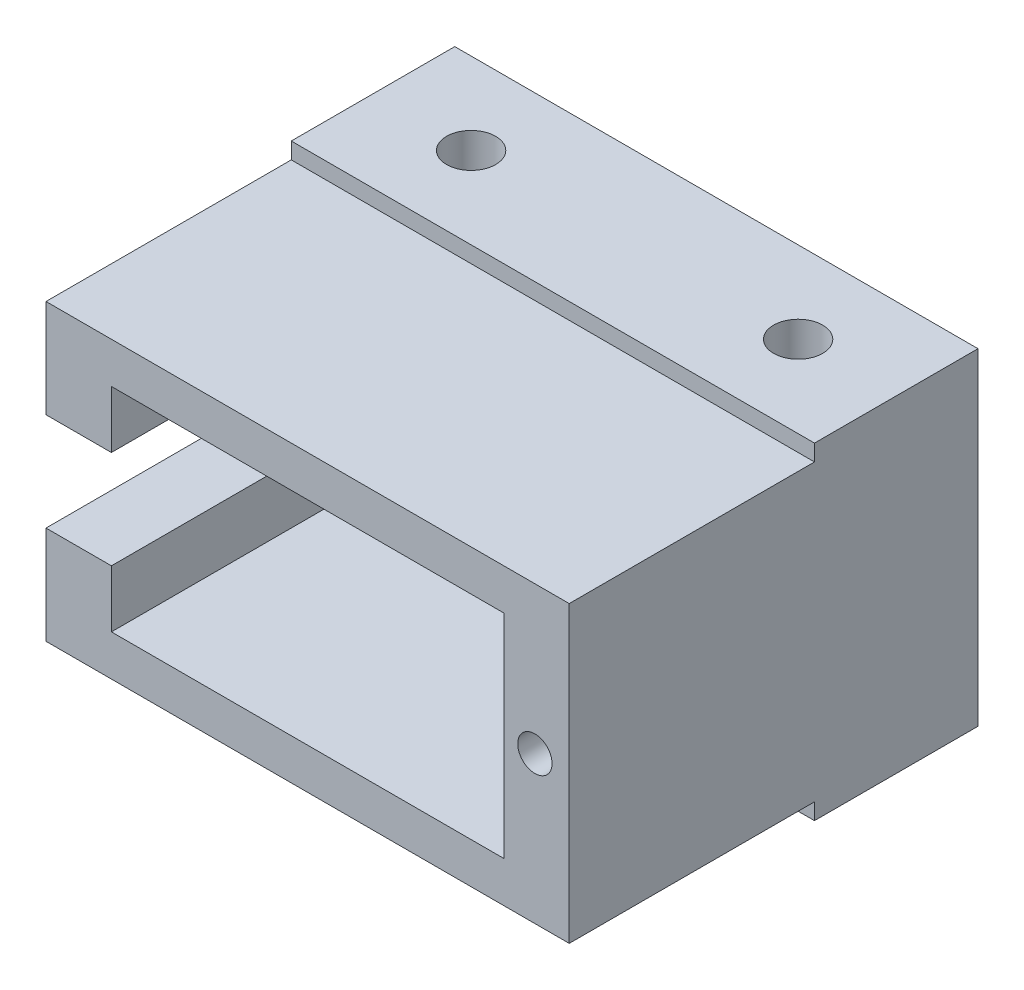
ISO-10303-21;
HEADER;
FILE_DESCRIPTION(('STEP AP214'),'2;1');
FILE_NAME('part.step','',(''),(''),'','','');
FILE_SCHEMA(('AUTOMOTIVE_DESIGN { 1 0 10303 214 1 1 1 1 }'));
ENDSEC;
DATA;
#1=APPLICATION_CONTEXT('core data for automotive mechanical design processes');
#2=APPLICATION_PROTOCOL_DEFINITION('international standard','automotive_design',2000,#1);
#3=PRODUCT_CONTEXT('',#1,'mechanical');
#4=PRODUCT('Part','Part','',(#3));
#5=PRODUCT_RELATED_PRODUCT_CATEGORY('part','',(#4));
#6=PRODUCT_DEFINITION_FORMATION('','',#4);
#7=PRODUCT_DEFINITION_CONTEXT('part definition',#1,'design');
#8=PRODUCT_DEFINITION('design','',#6,#7);
#9=PRODUCT_DEFINITION_SHAPE('','',#8);
#10=(LENGTH_UNIT() NAMED_UNIT(*) SI_UNIT(.MILLI.,.METRE.));
#11=(NAMED_UNIT(*) PLANE_ANGLE_UNIT() SI_UNIT($,.RADIAN.));
#12=(NAMED_UNIT(*) SI_UNIT($,.STERADIAN.) SOLID_ANGLE_UNIT());
#13=UNCERTAINTY_MEASURE_WITH_UNIT(LENGTH_MEASURE(1.E-05),#10,'distance_accuracy_value','');
#14=(GEOMETRIC_REPRESENTATION_CONTEXT(3) GLOBAL_UNCERTAINTY_ASSIGNED_CONTEXT((#13)) GLOBAL_UNIT_ASSIGNED_CONTEXT((#10,
#11,#12)) REPRESENTATION_CONTEXT('',''));
#15=CARTESIAN_POINT('',(0.,0.,0.));
#16=DIRECTION('',(0.,0.,1.));
#17=DIRECTION('',(1.,0.,0.));
#18=AXIS2_PLACEMENT_3D('',#15,#16,#17);
#19=CARTESIAN_POINT('',(-16.,10.,10.));
#20=DIRECTION('',(1.,0.,0.));
#21=DIRECTION('',(0.,0.,-1.));
#22=AXIS2_PLACEMENT_3D('',#19,#20,#21);
#23=PLANE('',#22);
#24=DIRECTION('',(0.,-1.,0.));
#25=VECTOR('',#24,1.);
#26=CARTESIAN_POINT('',(-16.,10.,0.));
#27=LINE('',#26,#25);
#28=CARTESIAN_POINT('',(-16.,10.,0.));
#29=VERTEX_POINT('',#28);
#30=CARTESIAN_POINT('',(-16.,3.,0.));
#31=VERTEX_POINT('',#30);
#32=EDGE_CURVE('E265',#29,#31,#27,.T.);
#33=ORIENTED_EDGE('',*,*,#32,.T.);
#34=DIRECTION('',(0.,0.,-1.));
#35=VECTOR('',#34,1.);
#36=CARTESIAN_POINT('',(-16.,3.,0.));
#37=LINE('',#36,#35);
#38=CARTESIAN_POINT('',(-16.,3.,25.));
#39=VERTEX_POINT('',#38);
#40=EDGE_CURVE('E171',#39,#31,#37,.T.);
#41=ORIENTED_EDGE('',*,*,#40,.F.);
#42=DIRECTION('',(0.,-1.,0.));
#43=VECTOR('',#42,1.);
#44=CARTESIAN_POINT('',(-16.,-9.00000000000001,25.));
#45=LINE('',#44,#43);
#46=CARTESIAN_POINT('',(-16.,9.,25.));
#47=VERTEX_POINT('',#46);
#48=EDGE_CURVE('E222',#47,#39,#45,.T.);
#49=ORIENTED_EDGE('',*,*,#48,.F.);
#50=DIRECTION('',(0.,0.,-1.));
#51=VECTOR('',#50,1.);
#52=CARTESIAN_POINT('',(-16.,9.,25.));
#53=LINE('',#52,#51);
#54=CARTESIAN_POINT('',(-16.,9.,10.));
#55=VERTEX_POINT('',#54);
#56=EDGE_CURVE('E232',#47,#55,#53,.T.);
#57=ORIENTED_EDGE('',*,*,#56,.T.);
#58=DIRECTION('',(0.,-1.,0.));
#59=VECTOR('',#58,1.);
#60=CARTESIAN_POINT('',(-16.,10.,10.));
#61=LINE('',#60,#59);
#62=CARTESIAN_POINT('',(-16.,10.,10.));
#63=VERTEX_POINT('',#62);
#64=EDGE_CURVE('E256',#63,#55,#61,.T.);
#65=ORIENTED_EDGE('',*,*,#64,.F.);
#66=DIRECTION('',(0.,0.,-1.));
#67=VECTOR('',#66,1.);
#68=CARTESIAN_POINT('',(-16.,10.,10.));
#69=LINE('',#68,#67);
#70=EDGE_CURVE('E45',#63,#29,#69,.T.);
#71=ORIENTED_EDGE('',*,*,#70,.T.);
#72=EDGE_LOOP('',(#33,#41,#49,#57,#65,#71));
#73=FACE_BOUND('',#72,.T.);
#74=ADVANCED_FACE('F37',(#73),#23,.F.);
#75=CARTESIAN_POINT('',(-12.,6.5,25.));
#76=DIRECTION('',(1.,0.,0.));
#77=DIRECTION('',(0.,0.,-1.));
#78=AXIS2_PLACEMENT_3D('',#75,#76,#77);
#79=PLANE('',#78);
#80=DIRECTION('',(0.,0.,-1.));
#81=VECTOR('',#80,1.);
#82=CARTESIAN_POINT('',(-12.,3.,0.));
#83=LINE('',#82,#81);
#84=CARTESIAN_POINT('',(-12.,3.,25.));
#85=VERTEX_POINT('',#84);
#86=CARTESIAN_POINT('',(-12.,3.,10.));
#87=VERTEX_POINT('',#86);
#88=EDGE_CURVE('E178',#85,#87,#83,.T.);
#89=ORIENTED_EDGE('',*,*,#88,.T.);
#90=DIRECTION('',(0.,-1.,0.));
#91=VECTOR('',#90,1.);
#92=CARTESIAN_POINT('',(-12.,6.5,10.));
#93=LINE('',#92,#91);
#94=CARTESIAN_POINT('',(-12.,6.5,10.));
#95=VERTEX_POINT('',#94);
#96=EDGE_CURVE('E206',#95,#87,#93,.T.);
#97=ORIENTED_EDGE('',*,*,#96,.F.);
#98=DIRECTION('',(0.,0.,-1.));
#99=VECTOR('',#98,1.);
#100=CARTESIAN_POINT('',(-12.,6.5,25.));
#101=LINE('',#100,#99);
#102=CARTESIAN_POINT('',(-12.,6.5,25.));
#103=VERTEX_POINT('',#102);
#104=EDGE_CURVE('E216',#103,#95,#101,.T.);
#105=ORIENTED_EDGE('',*,*,#104,.F.);
#106=DIRECTION('',(0.,-1.,0.));
#107=VECTOR('',#106,1.);
#108=CARTESIAN_POINT('',(-12.,6.5,25.));
#109=LINE('',#108,#107);
#110=EDGE_CURVE('E193',#103,#85,#109,.T.);
#111=ORIENTED_EDGE('',*,*,#110,.T.);
#112=EDGE_LOOP('',(#89,#97,#105,#111));
#113=FACE_BOUND('',#112,.T.);
#114=ADVANCED_FACE('F352',(#113),#79,.T.);
#115=CARTESIAN_POINT('',(0.,0.,10.));
#116=DIRECTION('',(0.,0.,1.));
#117=DIRECTION('',(1.,0.,0.));
#118=AXIS2_PLACEMENT_3D('',#115,#116,#117);
#119=PLANE('',#118);
#120=DIRECTION('',(-1.,0.,0.));
#121=VECTOR('',#120,1.);
#122=CARTESIAN_POINT('',(-16.,9.,10.));
#123=LINE('',#122,#121);
#124=CARTESIAN_POINT('',(16.,9.,10.));
#125=VERTEX_POINT('',#124);
#126=EDGE_CURVE('E235',#125,#55,#123,.T.);
#127=ORIENTED_EDGE('',*,*,#126,.F.);
#128=DIRECTION('',(0.,1.,0.));
#129=VECTOR('',#128,1.);
#130=CARTESIAN_POINT('',(16.,10.,10.));
#131=LINE('',#130,#129);
#132=CARTESIAN_POINT('',(16.,10.,10.));
#133=VERTEX_POINT('',#132);
#134=EDGE_CURVE('E253',#125,#133,#131,.T.);
#135=ORIENTED_EDGE('',*,*,#134,.T.);
#136=DIRECTION('',(-1.,0.,0.));
#137=VECTOR('',#136,1.);
#138=CARTESIAN_POINT('',(-16.,10.,10.));
#139=LINE('',#138,#137);
#140=EDGE_CURVE('E252',#133,#63,#139,.T.);
#141=ORIENTED_EDGE('',*,*,#140,.T.);
#142=ORIENTED_EDGE('',*,*,#64,.T.);
#143=EDGE_LOOP('',(#127,#135,#141,#142));
#144=FACE_BOUND('',#143,.T.);
#145=ADVANCED_FACE('F363',(#144),#119,.T.);
#146=CARTESIAN_POINT('',(16.,10.,10.));
#147=DIRECTION('',(-1.,0.,0.));
#148=DIRECTION('',(0.,-1.,0.));
#149=AXIS2_PLACEMENT_3D('',#146,#147,#148);
#150=PLANE('',#149);
#151=DIRECTION('',(0.,1.,0.));
#152=VECTOR('',#151,1.);
#153=CARTESIAN_POINT('',(16.,10.,0.));
#154=LINE('',#153,#152);
#155=CARTESIAN_POINT('',(16.,-10.,0.));
#156=VERTEX_POINT('',#155);
#157=CARTESIAN_POINT('',(16.,10.,0.));
#158=VERTEX_POINT('',#157);
#159=EDGE_CURVE('E249',#156,#158,#154,.T.);
#160=ORIENTED_EDGE('',*,*,#159,.T.);
#161=DIRECTION('',(0.,0.,-1.));
#162=VECTOR('',#161,1.);
#163=CARTESIAN_POINT('',(16.,10.,10.));
#164=LINE('',#163,#162);
#165=EDGE_CURVE('E11',#133,#158,#164,.T.);
#166=ORIENTED_EDGE('',*,*,#165,.F.);
#167=ORIENTED_EDGE('',*,*,#134,.F.);
#168=DIRECTION('',(0.,0.,-1.));
#169=VECTOR('',#168,1.);
#170=CARTESIAN_POINT('',(16.,9.,25.));
#171=LINE('',#170,#169);
#172=CARTESIAN_POINT('',(16.,9.,25.));
#173=VERTEX_POINT('',#172);
#174=EDGE_CURVE('E240',#173,#125,#171,.T.);
#175=ORIENTED_EDGE('',*,*,#174,.F.);
#176=DIRECTION('',(0.,1.,0.));
#177=VECTOR('',#176,1.);
#178=CARTESIAN_POINT('',(16.,9.,25.));
#179=LINE('',#178,#177);
#180=CARTESIAN_POINT('',(16.,-9.,25.));
#181=VERTEX_POINT('',#180);
#182=EDGE_CURVE('E228',#181,#173,#179,.T.);
#183=ORIENTED_EDGE('',*,*,#182,.F.);
#184=DIRECTION('',(0.,0.,-1.));
#185=VECTOR('',#184,1.);
#186=CARTESIAN_POINT('',(16.,-9.,25.));
#187=LINE('',#186,#185);
#188=CARTESIAN_POINT('',(16.,-9.,10.));
#189=VERTEX_POINT('',#188);
#190=EDGE_CURVE('E243',#181,#189,#187,.T.);
#191=ORIENTED_EDGE('',*,*,#190,.T.);
#192=CARTESIAN_POINT('',(16.,-10.,10.));
#193=VERTEX_POINT('',#192);
#194=EDGE_CURVE('E250',#193,#189,#131,.T.);
#195=ORIENTED_EDGE('',*,*,#194,.F.);
#196=DIRECTION('',(0.,0.,-1.));
#197=VECTOR('',#196,1.);
#198=CARTESIAN_POINT('',(16.,-10.,10.));
#199=LINE('',#198,#197);
#200=EDGE_CURVE('E260',#193,#156,#199,.T.);
#201=ORIENTED_EDGE('',*,*,#200,.T.);
#202=EDGE_LOOP('',(#160,#166,#167,#175,#183,#191,#195,#201));
#203=FACE_BOUND('',#202,.T.);
#204=ADVANCED_FACE('F39',(#203),#150,.F.);
#205=CARTESIAN_POINT('',(-16.,10.,10.));
#206=DIRECTION('',(0.,-1.,0.));
#207=DIRECTION('',(0.,0.,-1.));
#208=AXIS2_PLACEMENT_3D('',#205,#206,#207);
#209=PLANE('',#208);
#210=CARTESIAN_POINT('',(-10.,10.,5.));
#211=DIRECTION('',(0.,1.,0.));
#212=DIRECTION('',(0.,0.,1.));
#213=AXIS2_PLACEMENT_3D('',#210,#211,#212);
#214=CIRCLE('',#213,1.5);
#215=CARTESIAN_POINT('',(-10.,10.,6.50000000000001));
#216=VERTEX_POINT('',#215);
#217=EDGE_CURVE('E299',#216,#216,#214,.T.);
#218=ORIENTED_EDGE('',*,*,#217,.F.);
#219=EDGE_LOOP('',(#218));
#220=FACE_BOUND('',#219,.T.);
#221=CARTESIAN_POINT('',(9.99999999999999,10.,5.));
#222=DIRECTION('',(0.,1.,0.));
#223=DIRECTION('',(0.,0.,1.));
#224=AXIS2_PLACEMENT_3D('',#221,#222,#223);
#225=CIRCLE('',#224,1.5);
#226=CARTESIAN_POINT('',(9.99999999999999,10.,6.50000000000001));
#227=VERTEX_POINT('',#226);
#228=EDGE_CURVE('E296',#227,#227,#225,.T.);
#229=ORIENTED_EDGE('',*,*,#228,.F.);
#230=EDGE_LOOP('',(#229));
#231=FACE_BOUND('',#230,.T.);
#232=DIRECTION('',(-1.,0.,0.));
#233=VECTOR('',#232,1.);
#234=CARTESIAN_POINT('',(-16.,10.,0.));
#235=LINE('',#234,#233);
#236=EDGE_CURVE('E263',#158,#29,#235,.T.);
#237=ORIENTED_EDGE('',*,*,#236,.T.);
#238=ORIENTED_EDGE('',*,*,#70,.F.);
#239=ORIENTED_EDGE('',*,*,#140,.F.);
#240=ORIENTED_EDGE('',*,*,#165,.T.);
#241=EDGE_LOOP('',(#237,#238,#239,#240));
#242=FACE_BOUND('',#241,.T.);
#243=ADVANCED_FACE('F311',(#220,#231,#242),#209,.F.);
#244=CARTESIAN_POINT('',(-16.,-3.,25.));
#245=VERTEX_POINT('',#244);
#246=CARTESIAN_POINT('',(-16.,-9.00000000000001,25.));
#247=VERTEX_POINT('',#246);
#248=EDGE_CURVE('E226',#245,#247,#45,.T.);
#249=ORIENTED_EDGE('',*,*,#248,.F.);
#250=DIRECTION('',(0.,0.,1.));
#251=VECTOR('',#250,1.);
#252=CARTESIAN_POINT('',(-16.,-3.,25.));
#253=LINE('',#252,#251);
#254=CARTESIAN_POINT('',(-16.,-3.,0.));
#255=VERTEX_POINT('',#254);
#256=EDGE_CURVE('E287',#255,#245,#253,.T.);
#257=ORIENTED_EDGE('',*,*,#256,.F.);
#258=CARTESIAN_POINT('',(-16.,-10.,0.));
#259=VERTEX_POINT('',#258);
#260=EDGE_CURVE('E176',#255,#259,#27,.T.);
#261=ORIENTED_EDGE('',*,*,#260,.T.);
#262=DIRECTION('',(0.,0.,-1.));
#263=VECTOR('',#262,1.);
#264=CARTESIAN_POINT('',(-16.,-10.,10.));
#265=LINE('',#264,#263);
#266=CARTESIAN_POINT('',(-16.,-10.,10.));
#267=VERTEX_POINT('',#266);
#268=EDGE_CURVE('E272',#267,#259,#265,.T.);
#269=ORIENTED_EDGE('',*,*,#268,.F.);
#270=CARTESIAN_POINT('',(-16.,-9.,10.));
#271=VERTEX_POINT('',#270);
#272=EDGE_CURVE('E255',#271,#267,#61,.T.);
#273=ORIENTED_EDGE('',*,*,#272,.F.);
#274=DIRECTION('',(0.,0.,-1.));
#275=VECTOR('',#274,1.);
#276=CARTESIAN_POINT('',(-16.,-9.00000000000001,25.));
#277=LINE('',#276,#275);
#278=EDGE_CURVE('E246',#247,#271,#277,.T.);
#279=ORIENTED_EDGE('',*,*,#278,.F.);
#280=EDGE_LOOP('',(#249,#257,#261,#269,#273,#279));
#281=FACE_BOUND('',#280,.T.);
#282=ADVANCED_FACE('F314',(#281),#23,.F.);
#283=CARTESIAN_POINT('',(-16.,-10.,10.));
#284=DIRECTION('',(0.,1.,0.));
#285=DIRECTION('',(0.,0.,1.));
#286=AXIS2_PLACEMENT_3D('',#283,#284,#285);
#287=PLANE('',#286);
#288=CARTESIAN_POINT('',(-10.,-10.,5.));
#289=DIRECTION('',(0.,1.,0.));
#290=DIRECTION('',(0.,0.,1.));
#291=AXIS2_PLACEMENT_3D('',#288,#289,#290);
#292=CIRCLE('',#291,1.5);
#293=CARTESIAN_POINT('',(-10.,-10.,6.50000000000001));
#294=VERTEX_POINT('',#293);
#295=EDGE_CURVE('E293',#294,#294,#292,.F.);
#296=ORIENTED_EDGE('',*,*,#295,.F.);
#297=EDGE_LOOP('',(#296));
#298=FACE_BOUND('',#297,.T.);
#299=CARTESIAN_POINT('',(9.99999999999999,-10.,5.));
#300=DIRECTION('',(0.,1.,0.));
#301=DIRECTION('',(0.,0.,1.));
#302=AXIS2_PLACEMENT_3D('',#299,#300,#301);
#303=CIRCLE('',#302,1.5);
#304=CARTESIAN_POINT('',(9.99999999999999,-10.,6.50000000000001));
#305=VERTEX_POINT('',#304);
#306=EDGE_CURVE('E300',#305,#305,#303,.F.);
#307=ORIENTED_EDGE('',*,*,#306,.F.);
#308=EDGE_LOOP('',(#307));
#309=FACE_BOUND('',#308,.T.);
#310=DIRECTION('',(1.,0.,0.));
#311=VECTOR('',#310,1.);
#312=CARTESIAN_POINT('',(-16.,-10.,0.));
#313=LINE('',#312,#311);
#314=EDGE_CURVE('E268',#259,#156,#313,.T.);
#315=ORIENTED_EDGE('',*,*,#314,.T.);
#316=ORIENTED_EDGE('',*,*,#200,.F.);
#317=DIRECTION('',(1.,0.,0.));
#318=VECTOR('',#317,1.);
#319=CARTESIAN_POINT('',(-16.,-10.,10.));
#320=LINE('',#319,#318);
#321=EDGE_CURVE('E258',#267,#193,#320,.T.);
#322=ORIENTED_EDGE('',*,*,#321,.F.);
#323=ORIENTED_EDGE('',*,*,#268,.T.);
#324=EDGE_LOOP('',(#315,#316,#322,#323));
#325=FACE_BOUND('',#324,.T.);
#326=ADVANCED_FACE('F322',(#298,#309,#325),#287,.F.);
#327=DIRECTION('',(1.,0.,0.));
#328=VECTOR('',#327,1.);
#329=CARTESIAN_POINT('',(16.,-9.,10.));
#330=LINE('',#329,#328);
#331=EDGE_CURVE('E221',#271,#189,#330,.T.);
#332=ORIENTED_EDGE('',*,*,#331,.F.);
#333=ORIENTED_EDGE('',*,*,#272,.T.);
#334=ORIENTED_EDGE('',*,*,#321,.T.);
#335=ORIENTED_EDGE('',*,*,#194,.T.);
#336=EDGE_LOOP('',(#332,#333,#334,#335));
#337=FACE_BOUND('',#336,.T.);
#338=ADVANCED_FACE('F368',(#337),#119,.T.);
#339=CARTESIAN_POINT('',(0.,0.,0.));
#340=DIRECTION('',(0.,0.,1.));
#341=DIRECTION('',(1.,0.,0.));
#342=AXIS2_PLACEMENT_3D('',#339,#340,#341);
#343=PLANE('',#342);
#344=DIRECTION('',(0.,-1.,0.));
#345=VECTOR('',#344,1.);
#346=CARTESIAN_POINT('',(-12.,-3.,0.));
#347=LINE('',#346,#345);
#348=CARTESIAN_POINT('',(-12.,3.,0.));
#349=VERTEX_POINT('',#348);
#350=CARTESIAN_POINT('',(-12.,-3.,0.));
#351=VERTEX_POINT('',#350);
#352=EDGE_CURVE('E165',#349,#351,#347,.T.);
#353=ORIENTED_EDGE('',*,*,#352,.F.);
#354=DIRECTION('',(-1.,0.,0.));
#355=VECTOR('',#354,1.);
#356=CARTESIAN_POINT('',(-12.,3.,0.));
#357=LINE('',#356,#355);
#358=EDGE_CURVE('E203',#349,#31,#357,.T.);
#359=ORIENTED_EDGE('',*,*,#358,.T.);
#360=ORIENTED_EDGE('',*,*,#32,.F.);
#361=ORIENTED_EDGE('',*,*,#236,.F.);
#362=ORIENTED_EDGE('',*,*,#159,.F.);
#363=ORIENTED_EDGE('',*,*,#314,.F.);
#364=ORIENTED_EDGE('',*,*,#260,.F.);
#365=DIRECTION('',(-1.,0.,0.));
#366=VECTOR('',#365,1.);
#367=CARTESIAN_POINT('',(-12.,-3.,0.));
#368=LINE('',#367,#366);
#369=EDGE_CURVE('E158',#351,#255,#368,.T.);
#370=ORIENTED_EDGE('',*,*,#369,.F.);
#371=EDGE_LOOP('',(#353,#359,#360,#361,#362,#363,#364,#370));
#372=FACE_BOUND('',#371,.T.);
#373=ADVANCED_FACE('F174',(#372),#343,.F.);
#374=CARTESIAN_POINT('',(0.,0.,25.));
#375=DIRECTION('',(0.,0.,-1.));
#376=DIRECTION('',(-1.,0.,0.));
#377=AXIS2_PLACEMENT_3D('',#374,#375,#376);
#378=PLANE('',#377);
#379=CARTESIAN_POINT('',(13.9,0.,25.));
#380=DIRECTION('',(0.,0.,1.));
#381=DIRECTION('',(1.,0.,0.));
#382=AXIS2_PLACEMENT_3D('',#379,#380,#381);
#383=CIRCLE('',#382,1.05);
#384=CARTESIAN_POINT('',(14.95,0.,25.));
#385=VERTEX_POINT('',#384);
#386=EDGE_CURVE('E290',#385,#385,#383,.T.);
#387=ORIENTED_EDGE('',*,*,#386,.F.);
#388=EDGE_LOOP('',(#387));
#389=FACE_BOUND('',#388,.T.);
#390=ORIENTED_EDGE('',*,*,#48,.T.);
#391=DIRECTION('',(-1.,0.,0.));
#392=VECTOR('',#391,1.);
#393=CARTESIAN_POINT('',(-12.,3.,25.));
#394=LINE('',#393,#392);
#395=EDGE_CURVE('E181',#85,#39,#394,.T.);
#396=ORIENTED_EDGE('',*,*,#395,.F.);
#397=ORIENTED_EDGE('',*,*,#110,.F.);
#398=DIRECTION('',(-1.,0.,0.));
#399=VECTOR('',#398,1.);
#400=CARTESIAN_POINT('',(-12.,6.5,25.));
#401=LINE('',#400,#399);
#402=CARTESIAN_POINT('',(12.,6.5,25.));
#403=VERTEX_POINT('',#402);
#404=EDGE_CURVE('E189',#403,#103,#401,.T.);
#405=ORIENTED_EDGE('',*,*,#404,.F.);
#406=DIRECTION('',(0.,1.,0.));
#407=VECTOR('',#406,1.);
#408=CARTESIAN_POINT('',(12.,6.5,25.));
#409=LINE('',#408,#407);
#410=CARTESIAN_POINT('',(12.,-6.5,25.));
#411=VERTEX_POINT('',#410);
#412=EDGE_CURVE('E187',#411,#403,#409,.T.);
#413=ORIENTED_EDGE('',*,*,#412,.F.);
#414=DIRECTION('',(1.,0.,0.));
#415=VECTOR('',#414,1.);
#416=CARTESIAN_POINT('',(-12.,-6.5,25.));
#417=LINE('',#416,#415);
#418=CARTESIAN_POINT('',(-12.,-6.5,25.));
#419=VERTEX_POINT('',#418);
#420=EDGE_CURVE('E196',#419,#411,#417,.T.);
#421=ORIENTED_EDGE('',*,*,#420,.F.);
#422=CARTESIAN_POINT('',(-12.,-3.,25.));
#423=VERTEX_POINT('',#422);
#424=EDGE_CURVE('E192',#423,#419,#109,.T.);
#425=ORIENTED_EDGE('',*,*,#424,.F.);
#426=DIRECTION('',(-1.,0.,0.));
#427=VECTOR('',#426,1.);
#428=CARTESIAN_POINT('',(-12.,-3.,25.));
#429=LINE('',#428,#427);
#430=EDGE_CURVE('E177',#423,#245,#429,.T.);
#431=ORIENTED_EDGE('',*,*,#430,.T.);
#432=ORIENTED_EDGE('',*,*,#248,.T.);
#433=DIRECTION('',(1.,0.,0.));
#434=VECTOR('',#433,1.);
#435=CARTESIAN_POINT('',(16.,-9.,25.));
#436=LINE('',#435,#434);
#437=EDGE_CURVE('E225',#247,#181,#436,.T.);
#438=ORIENTED_EDGE('',*,*,#437,.T.);
#439=ORIENTED_EDGE('',*,*,#182,.T.);
#440=DIRECTION('',(-1.,0.,0.));
#441=VECTOR('',#440,1.);
#442=CARTESIAN_POINT('',(-16.,9.,25.));
#443=LINE('',#442,#441);
#444=EDGE_CURVE('E230',#173,#47,#443,.T.);
#445=ORIENTED_EDGE('',*,*,#444,.T.);
#446=EDGE_LOOP('',(#390,#396,#397,#405,#413,#421,#425,#431,#432,#438,#439,#445));
#447=FACE_BOUND('',#446,.T.);
#448=ADVANCED_FACE('F331',(#389,#447),#378,.F.);
#449=CARTESIAN_POINT('',(16.,-9.,25.));
#450=DIRECTION('',(0.,1.,0.));
#451=DIRECTION('',(-1.,0.,0.));
#452=AXIS2_PLACEMENT_3D('',#449,#450,#451);
#453=PLANE('',#452);
#454=ORIENTED_EDGE('',*,*,#331,.T.);
#455=ORIENTED_EDGE('',*,*,#190,.F.);
#456=ORIENTED_EDGE('',*,*,#437,.F.);
#457=ORIENTED_EDGE('',*,*,#278,.T.);
#458=EDGE_LOOP('',(#454,#455,#456,#457));
#459=FACE_BOUND('',#458,.T.);
#460=ADVANCED_FACE('F366',(#459),#453,.F.);
#461=CARTESIAN_POINT('',(-16.,9.,25.));
#462=DIRECTION('',(0.,-1.,0.));
#463=DIRECTION('',(0.,0.,-1.));
#464=AXIS2_PLACEMENT_3D('',#461,#462,#463);
#465=PLANE('',#464);
#466=ORIENTED_EDGE('',*,*,#126,.T.);
#467=ORIENTED_EDGE('',*,*,#56,.F.);
#468=ORIENTED_EDGE('',*,*,#444,.F.);
#469=ORIENTED_EDGE('',*,*,#174,.T.);
#470=EDGE_LOOP('',(#466,#467,#468,#469));
#471=FACE_BOUND('',#470,.T.);
#472=ADVANCED_FACE('F361',(#471),#465,.F.);
#473=CARTESIAN_POINT('',(12.,6.5,25.));
#474=DIRECTION('',(-1.,0.,0.));
#475=DIRECTION('',(0.,0.,1.));
#476=AXIS2_PLACEMENT_3D('',#473,#474,#475);
#477=PLANE('',#476);
#478=DIRECTION('',(0.,1.,0.));
#479=VECTOR('',#478,1.);
#480=CARTESIAN_POINT('',(12.,6.5,10.));
#481=LINE('',#480,#479);
#482=CARTESIAN_POINT('',(12.,-6.5,10.));
#483=VERTEX_POINT('',#482);
#484=CARTESIAN_POINT('',(12.,6.5,10.));
#485=VERTEX_POINT('',#484);
#486=EDGE_CURVE('E199',#483,#485,#481,.T.);
#487=ORIENTED_EDGE('',*,*,#486,.F.);
#488=DIRECTION('',(0.,0.,-1.));
#489=VECTOR('',#488,1.);
#490=CARTESIAN_POINT('',(12.,-6.5,25.));
#491=LINE('',#490,#489);
#492=EDGE_CURVE('E198',#411,#483,#491,.T.);
#493=ORIENTED_EDGE('',*,*,#492,.F.);
#494=ORIENTED_EDGE('',*,*,#412,.T.);
#495=DIRECTION('',(0.,0.,-1.));
#496=VECTOR('',#495,1.);
#497=CARTESIAN_POINT('',(12.,6.5,25.));
#498=LINE('',#497,#496);
#499=EDGE_CURVE('E218',#403,#485,#498,.T.);
#500=ORIENTED_EDGE('',*,*,#499,.T.);
#501=EDGE_LOOP('',(#487,#493,#494,#500));
#502=FACE_BOUND('',#501,.T.);
#503=ADVANCED_FACE('F343',(#502),#477,.T.);
#504=CARTESIAN_POINT('',(-12.,6.5,25.));
#505=DIRECTION('',(0.,-1.,0.));
#506=DIRECTION('',(0.,0.,-1.));
#507=AXIS2_PLACEMENT_3D('',#504,#505,#506);
#508=PLANE('',#507);
#509=DIRECTION('',(-1.,0.,0.));
#510=VECTOR('',#509,1.);
#511=CARTESIAN_POINT('',(-12.,6.5,10.));
#512=LINE('',#511,#510);
#513=EDGE_CURVE('E202',#485,#95,#512,.T.);
#514=ORIENTED_EDGE('',*,*,#513,.F.);
#515=ORIENTED_EDGE('',*,*,#499,.F.);
#516=ORIENTED_EDGE('',*,*,#404,.T.);
#517=ORIENTED_EDGE('',*,*,#104,.T.);
#518=EDGE_LOOP('',(#514,#515,#516,#517));
#519=FACE_BOUND('',#518,.T.);
#520=ADVANCED_FACE('F347',(#519),#508,.T.);
#521=DIRECTION('',(0.,0.,1.));
#522=VECTOR('',#521,1.);
#523=CARTESIAN_POINT('',(-12.,-3.,25.));
#524=LINE('',#523,#522);
#525=CARTESIAN_POINT('',(-12.,-3.,10.));
#526=VERTEX_POINT('',#525);
#527=EDGE_CURVE('E161',#526,#423,#524,.T.);
#528=ORIENTED_EDGE('',*,*,#527,.T.);
#529=ORIENTED_EDGE('',*,*,#424,.T.);
#530=DIRECTION('',(0.,0.,-1.));
#531=VECTOR('',#530,1.);
#532=CARTESIAN_POINT('',(-12.,-6.5,25.));
#533=LINE('',#532,#531);
#534=CARTESIAN_POINT('',(-12.,-6.5,10.));
#535=VERTEX_POINT('',#534);
#536=EDGE_CURVE('E213',#419,#535,#533,.T.);
#537=ORIENTED_EDGE('',*,*,#536,.T.);
#538=EDGE_CURVE('E60',#526,#535,#93,.T.);
#539=ORIENTED_EDGE('',*,*,#538,.F.);
#540=EDGE_LOOP('',(#528,#529,#537,#539));
#541=FACE_BOUND('',#540,.T.);
#542=ADVANCED_FACE('F337',(#541),#79,.T.);
#543=CARTESIAN_POINT('',(-12.,-6.5,25.));
#544=DIRECTION('',(0.,1.,0.));
#545=DIRECTION('',(0.,0.,1.));
#546=AXIS2_PLACEMENT_3D('',#543,#544,#545);
#547=PLANE('',#546);
#548=DIRECTION('',(1.,0.,0.));
#549=VECTOR('',#548,1.);
#550=CARTESIAN_POINT('',(-12.,-6.5,10.));
#551=LINE('',#550,#549);
#552=EDGE_CURVE('E190',#535,#483,#551,.T.);
#553=ORIENTED_EDGE('',*,*,#552,.F.);
#554=ORIENTED_EDGE('',*,*,#536,.F.);
#555=ORIENTED_EDGE('',*,*,#420,.T.);
#556=ORIENTED_EDGE('',*,*,#492,.T.);
#557=EDGE_LOOP('',(#553,#554,#555,#556));
#558=FACE_BOUND('',#557,.T.);
#559=ADVANCED_FACE('F339',(#558),#547,.T.);
#560=ORIENTED_EDGE('',*,*,#96,.T.);
#561=EDGE_CURVE('E209',#87,#526,#93,.T.);
#562=ORIENTED_EDGE('',*,*,#561,.T.);
#563=ORIENTED_EDGE('',*,*,#538,.T.);
#564=ORIENTED_EDGE('',*,*,#552,.T.);
#565=ORIENTED_EDGE('',*,*,#486,.T.);
#566=ORIENTED_EDGE('',*,*,#513,.T.);
#567=EDGE_LOOP('',(#560,#562,#563,#564,#565,#566));
#568=FACE_BOUND('',#567,.T.);
#569=ADVANCED_FACE('F341',(#568),#119,.T.);
#570=CARTESIAN_POINT('',(-12.,3.,0.));
#571=DIRECTION('',(0.,1.,0.));
#572=DIRECTION('',(0.,0.,1.));
#573=AXIS2_PLACEMENT_3D('',#570,#571,#572);
#574=PLANE('',#573);
#575=ORIENTED_EDGE('',*,*,#40,.T.);
#576=ORIENTED_EDGE('',*,*,#358,.F.);
#577=EDGE_CURVE('E162',#87,#349,#83,.T.);
#578=ORIENTED_EDGE('',*,*,#577,.F.);
#579=ORIENTED_EDGE('',*,*,#88,.F.);
#580=ORIENTED_EDGE('',*,*,#395,.T.);
#581=EDGE_LOOP('',(#575,#576,#578,#579,#580));
#582=FACE_BOUND('',#581,.T.);
#583=ADVANCED_FACE('F354',(#582),#574,.F.);
#584=CARTESIAN_POINT('',(-12.,-3.,25.));
#585=DIRECTION('',(0.,-1.,0.));
#586=DIRECTION('',(0.,0.,-1.));
#587=AXIS2_PLACEMENT_3D('',#584,#585,#586);
#588=PLANE('',#587);
#589=ORIENTED_EDGE('',*,*,#256,.T.);
#590=ORIENTED_EDGE('',*,*,#430,.F.);
#591=ORIENTED_EDGE('',*,*,#527,.F.);
#592=EDGE_CURVE('E52',#351,#526,#524,.T.);
#593=ORIENTED_EDGE('',*,*,#592,.F.);
#594=ORIENTED_EDGE('',*,*,#369,.T.);
#595=EDGE_LOOP('',(#589,#590,#591,#593,#594));
#596=FACE_BOUND('',#595,.T.);
#597=ADVANCED_FACE('F156',(#596),#588,.F.);
#598=CARTESIAN_POINT('',(-12.,0.,0.));
#599=DIRECTION('',(1.,0.,0.));
#600=DIRECTION('',(0.,0.,-1.));
#601=AXIS2_PLACEMENT_3D('',#598,#599,#600);
#602=PLANE('',#601);
#603=ORIENTED_EDGE('',*,*,#561,.F.);
#604=ORIENTED_EDGE('',*,*,#577,.T.);
#605=ORIENTED_EDGE('',*,*,#352,.T.);
#606=ORIENTED_EDGE('',*,*,#592,.T.);
#607=EDGE_LOOP('',(#603,#604,#605,#606));
#608=FACE_BOUND('',#607,.T.);
#609=ADVANCED_FACE('F166',(#608),#602,.F.);
#610=CARTESIAN_POINT('',(13.9,0.,19.));
#611=DIRECTION('',(0.,0.,1.));
#612=DIRECTION('',(1.,0.,0.));
#613=AXIS2_PLACEMENT_3D('',#610,#611,#612);
#614=CYLINDRICAL_SURFACE('',#613,1.05);
#615=CARTESIAN_POINT('',(13.9,0.,19.));
#616=DIRECTION('',(0.,0.,1.));
#617=DIRECTION('',(1.,0.,0.));
#618=AXIS2_PLACEMENT_3D('',#615,#616,#617);
#619=CIRCLE('',#618,1.05);
#620=CARTESIAN_POINT('',(14.95,0.,19.));
#621=VERTEX_POINT('',#620);
#622=EDGE_CURVE('E288',#621,#621,#619,.T.);
#623=ORIENTED_EDGE('',*,*,#622,.F.);
#624=EDGE_LOOP('',(#623));
#625=FACE_BOUND('',#624,.T.);
#626=ORIENTED_EDGE('',*,*,#386,.T.);
#627=EDGE_LOOP('',(#626));
#628=FACE_BOUND('',#627,.T.);
#629=ADVANCED_FACE('F436',(#625,#628),#614,.F.);
#630=CARTESIAN_POINT('',(13.9,0.,19.));
#631=DIRECTION('',(0.,0.,1.));
#632=DIRECTION('',(1.,0.,0.));
#633=AXIS2_PLACEMENT_3D('',#630,#631,#632);
#634=PLANE('',#633);
#635=ORIENTED_EDGE('',*,*,#622,.T.);
#636=EDGE_LOOP('',(#635));
#637=FACE_BOUND('',#636,.T.);
#638=ADVANCED_FACE('F414',(#637),#634,.T.);
#639=CARTESIAN_POINT('',(9.99999999999999,-10.001,5.));
#640=DIRECTION('',(0.,1.,0.));
#641=DIRECTION('',(0.,0.,1.));
#642=AXIS2_PLACEMENT_3D('',#639,#640,#641);
#643=CYLINDRICAL_SURFACE('',#642,1.5);
#644=ORIENTED_EDGE('',*,*,#228,.T.);
#645=EDGE_LOOP('',(#644));
#646=FACE_BOUND('',#645,.T.);
#647=ORIENTED_EDGE('',*,*,#306,.T.);
#648=EDGE_LOOP('',(#647));
#649=FACE_BOUND('',#648,.T.);
#650=ADVANCED_FACE('F409',(#646,#649),#643,.F.);
#651=CARTESIAN_POINT('',(-10.,-10.001,5.));
#652=DIRECTION('',(0.,1.,0.));
#653=DIRECTION('',(0.,0.,1.));
#654=AXIS2_PLACEMENT_3D('',#651,#652,#653);
#655=CYLINDRICAL_SURFACE('',#654,1.5);
#656=ORIENTED_EDGE('',*,*,#217,.T.);
#657=EDGE_LOOP('',(#656));
#658=FACE_BOUND('',#657,.T.);
#659=ORIENTED_EDGE('',*,*,#295,.T.);
#660=EDGE_LOOP('',(#659));
#661=FACE_BOUND('',#660,.T.);
#662=ADVANCED_FACE('F308',(#658,#661),#655,.F.);
#663=CLOSED_SHELL('',(#74,#114,#145,#204,#243,#282,#326,#338,#373,#448,#460,#472,#503,#520,#542,
#559,#569,#583,#597,#609,#629,#638,#650,#662));
#664=MANIFOLD_SOLID_BREP('B2',#663);
#665=ADVANCED_BREP_SHAPE_REPRESENTATION('',(#18,#664),#14);
#666=SHAPE_DEFINITION_REPRESENTATION(#9,#665);
ENDSEC;
END-ISO-10303-21;
